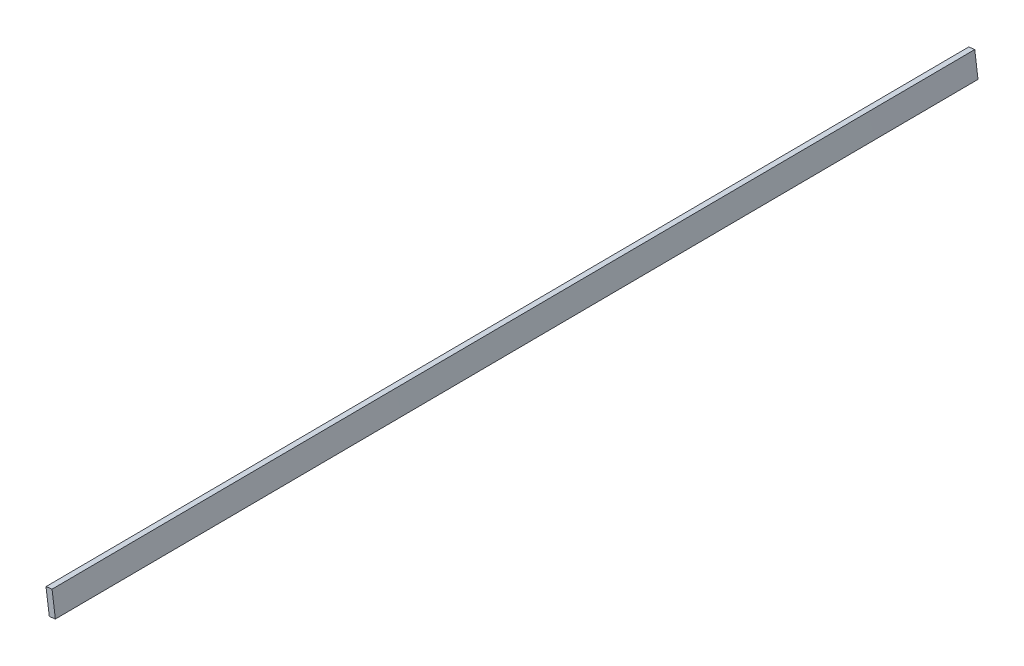
ISO-10303-21;
HEADER;
FILE_DESCRIPTION(('STEP AP214'),'2;1');
FILE_NAME('part.step','',(''),(''),'','','');
FILE_SCHEMA(('AUTOMOTIVE_DESIGN { 1 0 10303 214 1 1 1 1 }'));
ENDSEC;
DATA;
#1=APPLICATION_CONTEXT('core data for automotive mechanical design processes');
#2=APPLICATION_PROTOCOL_DEFINITION('international standard','automotive_design',2000,#1);
#3=PRODUCT_CONTEXT('',#1,'mechanical');
#4=PRODUCT('Part','Part','',(#3));
#5=PRODUCT_RELATED_PRODUCT_CATEGORY('part','',(#4));
#6=PRODUCT_DEFINITION_FORMATION('','',#4);
#7=PRODUCT_DEFINITION_CONTEXT('part definition',#1,'design');
#8=PRODUCT_DEFINITION('design','',#6,#7);
#9=PRODUCT_DEFINITION_SHAPE('','',#8);
#10=(LENGTH_UNIT() NAMED_UNIT(*) SI_UNIT(.MILLI.,.METRE.));
#11=(NAMED_UNIT(*) PLANE_ANGLE_UNIT() SI_UNIT($,.RADIAN.));
#12=(NAMED_UNIT(*) SI_UNIT($,.STERADIAN.) SOLID_ANGLE_UNIT());
#13=UNCERTAINTY_MEASURE_WITH_UNIT(LENGTH_MEASURE(1.E-05),#10,'distance_accuracy_value','');
#14=(GEOMETRIC_REPRESENTATION_CONTEXT(3) GLOBAL_UNCERTAINTY_ASSIGNED_CONTEXT((#13)) GLOBAL_UNIT_ASSIGNED_CONTEXT((#10,
#11,#12)) REPRESENTATION_CONTEXT('',''));
#15=CARTESIAN_POINT('',(0.,0.,0.));
#16=DIRECTION('',(0.,0.,1.));
#17=DIRECTION('',(1.,0.,0.));
#18=AXIS2_PLACEMENT_3D('',#15,#16,#17);
#19=CARTESIAN_POINT('',(0.,0.,-478.663));
#20=DIRECTION('',(0.,0.,-1.));
#21=DIRECTION('',(-1.,0.,0.));
#22=AXIS2_PLACEMENT_3D('',#19,#20,#21);
#23=PLANE('',#22);
#24=DIRECTION('',(0.99120712690939,0.132319430032148,0.));
#25=VECTOR('',#24,1.);
#26=CARTESIAN_POINT('',(3.15823560704575,-23.6583972694122,-478.663));
#27=LINE('',#26,#25);
#28=CARTESIAN_POINT('',(293.325645427331,15.0769843062237,-478.663));
#29=VERTEX_POINT('',#28);
#30=CARTESIAN_POINT('',(296.472728055268,15.4970984965758,-478.663));
#31=VERTEX_POINT('',#30);
#32=EDGE_CURVE('E211',#29,#31,#27,.T.);
#33=ORIENTED_EDGE('',*,*,#32,.T.);
#34=DIRECTION('',(0.131985681946742,-0.991251622828963,0.));
#35=VECTOR('',#34,1.);
#36=CARTESIAN_POINT('',(293.335609063056,39.0577927034886,-478.663));
#37=LINE('',#36,#35);
#38=CARTESIAN_POINT('',(298.149010473727,2.90772029199698,-478.663));
#39=VERTEX_POINT('',#38);
#40=EDGE_CURVE('E110',#31,#39,#37,.T.);
#41=ORIENTED_EDGE('',*,*,#40,.T.);
#42=CARTESIAN_POINT('',(423.387562730416,-0.598570683459927,-478.663));
#43=CARTESIAN_POINT('',(423.353927756293,-0.591395979490775,-478.663));
#44=CARTESIAN_POINT('',(423.21931714752,-0.562682079919149,-478.663));
#45=CARTESIAN_POINT('',(422.91635344577,-0.499447587671617,-478.663));
#46=CARTESIAN_POINT('',(422.412228818172,-0.393180215829817,-478.663));
#47=CARTESIAN_POINT('',(421.70748859617,-0.247042835446236,-478.663));
#48=CARTESIAN_POINT('',(420.803524813709,-0.0608019669566655,-478.663));
#49=CARTESIAN_POINT('',(419.701710383377,0.162485176428392,-478.663));
#50=CARTESIAN_POINT('',(418.403969401873,0.42193723491887,-478.663));
#51=CARTESIAN_POINT('',(416.912204339275,0.713898906283567,-478.663));
#52=CARTESIAN_POINT('',(415.229189009072,1.03708195332995,-478.663));
#53=CARTESIAN_POINT('',(413.357174388221,1.38616016731921,-478.663));
#54=CARTESIAN_POINT('',(411.299857620068,1.75939956386392,-478.663));
#55=CARTESIAN_POINT('',(409.060092771815,2.15209085915427,-478.663));
#56=CARTESIAN_POINT('',(406.641766459114,2.56039912737651,-478.663));
#57=CARTESIAN_POINT('',(404.04866688,2.98050952034267,-478.663));
#58=CARTESIAN_POINT('',(401.284982811694,3.40684602860176,-478.663));
#59=CARTESIAN_POINT('',(398.355056245213,3.83534149622065,-478.663));
#60=CARTESIAN_POINT('',(395.263527571514,4.26052524747009,-478.663));
#61=CARTESIAN_POINT('',(392.015373204561,4.67808858830662,-478.663));
#62=CARTESIAN_POINT('',(388.615478958681,5.08116931638825,-478.663));
#63=CARTESIAN_POINT('',(385.069286638117,5.46711366951576,-478.663));
#64=CARTESIAN_POINT('',(381.381970635892,5.82783453396013,-478.663));
#65=CARTESIAN_POINT('',(377.559192932435,6.15921060948389,-478.663));
#66=CARTESIAN_POINT('',(373.606851586853,6.45639091976692,-478.663));
#67=CARTESIAN_POINT('',(369.530453947723,6.71243770640048,-478.663));
#68=CARTESIAN_POINT('',(365.336119949899,6.92357395440403,-478.663));
#69=CARTESIAN_POINT('',(361.029807140813,7.08404404844039,-478.663));
#70=CARTESIAN_POINT('',(356.617523340991,7.18843396947195,-478.663));
#71=CARTESIAN_POINT('',(352.105426545498,7.23205813156872,-478.663));
#72=CARTESIAN_POINT('',(347.499385223467,7.21140010703142,-478.663));
#73=CARTESIAN_POINT('',(342.80568645406,7.11987185636663,-478.663));
#74=CARTESIAN_POINT('',(338.030192719595,6.95515066970667,-478.663));
#75=CARTESIAN_POINT('',(333.178936205884,6.71234985379041,-478.663));
#76=CARTESIAN_POINT('',(328.257698607244,6.38807962814831,-478.663));
#77=CARTESIAN_POINT('',(323.272118603679,5.98002284945519,-478.663));
#78=CARTESIAN_POINT('',(318.228182783313,5.48230898932139,-478.663));
#79=CARTESIAN_POINT('',(313.120651689801,4.89918891009641,-478.663));
#80=CARTESIAN_POINT('',(307.869311436917,4.18787475782382,-478.663));
#81=CARTESIAN_POINT('',(302.45646596458,3.48111483212754,-478.663));
#82=CARTESIAN_POINT('',(296.896259161603,2.74127410511817,-478.663));
#83=CARTESIAN_POINT('',(291.277526125806,1.99080851277614,-478.663));
#84=CARTESIAN_POINT('',(285.605919767471,1.22943621224605,-478.663));
#85=CARTESIAN_POINT('',(279.887290637041,0.457639017885714,-478.663));
#86=CARTESIAN_POINT('',(274.127034046233,-0.323609112130179,-478.663));
#87=CARTESIAN_POINT('',(268.330669910689,-1.11197613327778,-478.663));
#88=CARTESIAN_POINT('',(262.503543084913,-1.90586372829593,-478.663));
#89=CARTESIAN_POINT('',(256.651521274952,-2.70536888716537,-478.663));
#90=CARTESIAN_POINT('',(250.779899054847,-3.50651782193096,-478.663));
#91=CARTESIAN_POINT('',(244.894427750941,-4.30923724123935,-478.663));
#92=CARTESIAN_POINT('',(239.000567191879,-5.11132357461406,-478.663));
#93=CARTESIAN_POINT('',(233.103498264235,-5.90945278003363,-478.663));
#94=CARTESIAN_POINT('',(227.208964765834,-6.70337919450948,-478.663));
#95=CARTESIAN_POINT('',(221.322423209652,-7.49063506944608,-478.663));
#96=CARTESIAN_POINT('',(215.448997430527,-8.26717151250937,-478.663));
#97=CARTESIAN_POINT('',(209.594351574101,-9.03362813673483,-478.663));
#98=CARTESIAN_POINT('',(203.763409799043,-9.78454417055984,-478.663));
#99=CARTESIAN_POINT('',(197.96163086993,-10.5200053400287,-478.663));
#100=CARTESIAN_POINT('',(192.194232926486,-11.2365486354174,-478.663));
#101=CARTESIAN_POINT('',(186.466038684059,-11.9314142369755,-478.663));
#102=CARTESIAN_POINT('',(180.782436918827,-12.603274502764,-478.663));
#103=CARTESIAN_POINT('',(175.148233734479,-13.2482933836929,-478.663));
#104=CARTESIAN_POINT('',(169.568575962817,-13.8653038852164,-478.663));
#105=CARTESIAN_POINT('',(164.048210174808,-14.4510142998016,-478.663));
#106=CARTESIAN_POINT('',(158.592053261258,-15.0035265840128,-478.663));
#107=CARTESIAN_POINT('',(153.204921249941,-15.5202417100007,-478.663));
#108=CARTESIAN_POINT('',(147.891468535792,-15.9995243592631,-478.663));
#109=CARTESIAN_POINT('',(142.656399146351,-16.4389751743704,-478.663));
#110=CARTESIAN_POINT('',(137.504278758819,-16.8360326338407,-478.663));
#111=CARTESIAN_POINT('',(132.439787601187,-17.1897064470047,-478.663));
#112=CARTESIAN_POINT('',(127.467323045722,-17.4971602641448,-478.663));
#113=CARTESIAN_POINT('',(122.591261031339,-17.7570314908688,-478.663));
#114=CARTESIAN_POINT('',(117.815974853389,-17.9684391095265,-478.663));
#115=CARTESIAN_POINT('',(113.145771879521,-18.1292556955295,-478.663));
#116=CARTESIAN_POINT('',(108.584868364175,-18.2375350386864,-478.663));
#117=CARTESIAN_POINT('',(104.137640996795,-18.2939630983556,-478.663));
#118=CARTESIAN_POINT('',(99.8078887735024,-18.2954225965007,-478.663));
#119=CARTESIAN_POINT('',(95.5998472131619,-18.2423038335932,-478.663));
#120=CARTESIAN_POINT('',(91.5173192139185,-18.1338093844727,-478.663));
#121=CARTESIAN_POINT('',(87.5643031381508,-17.9682478198103,-478.663));
#122=CARTESIAN_POINT('',(83.7445855660069,-17.746248509974,-478.663));
#123=CARTESIAN_POINT('',(80.061874223133,-17.4671075395393,-478.663));
#124=CARTESIAN_POINT('',(76.519839715575,-17.13063972547,-478.663));
#125=CARTESIAN_POINT('',(73.1219854837755,-16.7361212710426,-478.663));
#126=CARTESIAN_POINT('',(69.8716450566022,-16.2843801388157,-478.663));
#127=CARTESIAN_POINT('',(66.7721547003917,-15.7751336760586,-478.663));
#128=CARTESIAN_POINT('',(63.8267343373244,-15.2086669368191,-478.663));
#129=CARTESIAN_POINT('',(61.0385935681709,-14.5844044129643,-478.663));
#130=CARTESIAN_POINT('',(58.4104140498924,-13.9039395891707,-478.663));
#131=CARTESIAN_POINT('',(55.9451842927062,-13.1663213913398,-478.663));
#132=CARTESIAN_POINT('',(53.6452481034751,-12.3733473758183,-478.663));
#133=CARTESIAN_POINT('',(51.513417248505,-11.5238097949324,-478.663));
#134=CARTESIAN_POINT('',(49.5520143575696,-10.6188443549477,-478.663));
#135=CARTESIAN_POINT('',(47.7628278881901,-9.65873376201667,-478.663));
#136=CARTESIAN_POINT('',(46.147868828537,-8.64407502954019,-478.663));
#137=CARTESIAN_POINT('',(44.7094832235471,-7.57379097901466,-478.663));
#138=CARTESIAN_POINT('',(43.4495535636796,-6.44836880629533,-478.663));
#139=CARTESIAN_POINT('',(42.3693155768158,-5.26841350717316,-478.663));
#140=CARTESIAN_POINT('',(41.4711549763534,-4.03269789142648,-478.663));
#141=CARTESIAN_POINT('',(40.7610437619866,-2.74155962108168,-478.663));
#142=CARTESIAN_POINT('',(40.2240782562071,-1.39842829488874,-478.663));
#143=CARTESIAN_POINT('',(40.026437002402,-0.465429755628102,-478.663));
#144=CARTESIAN_POINT('',(39.9278429354344,0.,-478.663));
#145=B_SPLINE_CURVE_WITH_KNOTS('',3,(#42,#43,#44,#45,#46,#47,#48,#49,#50,#51,#52,#53,#54,#55,
#56,#57,#58,#59,#60,#61,#62,#63,#64,#65,#66,#67,#68,#69,#70,#71,#72,#73,#74,#75,#76,#77,#78,#79,
#80,#81,#82,#83,#84,#85,#86,#87,#88,#89,#90,#91,#92,#93,#94,#95,#96,#97,#98,#99,#100,#101,#102,
#103,#104,#105,#106,#107,#108,#109,#110,#111,#112,#113,#114,#115,#116,#117,#118,#119,#120,#121,
#122,#123,#124,#125,#126,#127,#128,#129,#130,#131,#132,#133,#134,#135,#136,#137,#138,#139,#140,
#141,#142,#143,#144),.UNSPECIFIED.,.F.,.F.,(4,1,1,1,1,1,1,1,1,1,1,1,1,1,1,1,1,1,1,1,1,1,1,1,1,1,
1,1,1,1,1,1,1,1,1,1,1,1,1,1,1,1,1,1,1,1,1,1,1,1,1,1,1,1,1,1,1,1,1,1,1,1,1,1,1,1,1,1,1,1,1,1,1,1,
1,1,1,1,1,1,1,1,1,1,1,1,1,1,1,1,1,1,1,1,1,1,1,1,1,1,4),(0.,0.000263407441861152,
0.00105418354046938,0.002370412180423,0.00420937424793744,0.00656664230364534,
0.00943932529828362,0.012819753789679,0.0167027815540403,0.0210815676778737,0.0259455150023407,
0.0312877118873262,0.0370957960416438,0.0433615353737737,0.0500718116741128,0.0572152612400396,
0.0647788957380719,0.0727507221098705,0.0811160233175952,0.0898610226345078,0.0989726352727727,
0.108436394956907,0.11823658628776,0.128360674312887,0.138792302715597,0.149518641338252,
0.160525099370816,0.171796475500045,0.183320915835009,0.195083958581768,0.207073471204003,
0.219275662182765,0.231680048251389,0.244274442260697,0.257047871769566,0.269990725638771,
0.283092436221423,0.296418175051444,0.310577141849346,0.324901812537067,0.339379315631893,
0.353993476069731,0.368730577460443,0.383575671255915,0.398515484082567,0.413533959391771,
0.428618215440677,0.44375276659731,0.458921685899164,0.474112665452042,0.489310225086662,
0.504499416623933,0.519666846056783,0.534796932326458,0.549875724286475,0.564890467250726,
0.579825176535041,0.594667406411289,0.609402807723467,0.624019253145754,0.638501397294299,
0.652837209492562,0.667014500967881,0.68101931479257,0.694839720321596,0.708463964765985,
0.721880297346092,0.735076105433477,0.748040996187331,0.760763583019831,0.773232750583482,
0.785439521795172,0.797373026110578,0.80902262678145,0.820380871717842,0.83143652712263,
0.842183519415127,0.852612082472283,0.86271472951419,0.872485157300502,0.881915470474977,
0.891000132552545,0.899734087744223,0.908112589055665,0.916131607778471,0.923788842688074,
0.931081963902189,0.938011213981012,0.944577653857526,0.950785321002633,0.956638125291176,
0.962146840114847,0.967320917546812,0.972179373952079,0.9767415246109,0.981036728216416,
0.985098918921906,0.988971863590748,0.992706768868038,0.996361744803825,1.),.UNSPECIFIED.);
#146=CARTESIAN_POINT('',(295.006102188739,2.48865379447443,-478.663));
#147=VERTEX_POINT('',#146);
#148=EDGE_CURVE('E68',#39,#147,#145,.T.);
#149=ORIENTED_EDGE('',*,*,#148,.T.);
#150=DIRECTION('',(-0.132319430032147,0.99120712690939,0.));
#151=VECTOR('',#150,1.);
#152=CARTESIAN_POINT('',(290.167409820285,38.7353815756355,-478.663));
#153=LINE('',#152,#151);
#154=EDGE_CURVE('E12',#147,#29,#153,.T.);
#155=ORIENTED_EDGE('',*,*,#154,.T.);
#156=EDGE_LOOP('',(#33,#41,#149,#155));
#157=FACE_BOUND('',#156,.T.);
#158=ADVANCED_FACE('F57',(#157),#23,.T.);
#159=CARTESIAN_POINT('',(0.,0.,0.));
#160=DIRECTION('',(0.,0.,1.));
#161=DIRECTION('',(1.,0.,0.));
#162=AXIS2_PLACEMENT_3D('',#159,#160,#161);
#163=PLANE('',#162);
#164=DIRECTION('',(-0.134658441587376,0.99089207490486,0.));
#165=VECTOR('',#164,1.);
#166=CARTESIAN_POINT('',(289.604328188599,39.3561201047853,0.));
#167=LINE('',#166,#165);
#168=CARTESIAN_POINT('',(295.036807925605,-0.619102057485672,0.));
#169=VERTEX_POINT('',#168);
#170=CARTESIAN_POINT('',(293.326645717445,11.965227293806,0.));
#171=VERTEX_POINT('',#170);
#172=EDGE_CURVE('E176',#169,#171,#167,.T.);
#173=ORIENTED_EDGE('',*,*,#172,.F.);
#174=CARTESIAN_POINT('',(272.758362456909,-3.65581401828483,0.));
#175=CARTESIAN_POINT('',(273.323038862609,-3.57873827863166,0.));
#176=CARTESIAN_POINT('',(276.358796537806,-3.16431991771855,0.));
#177=CARTESIAN_POINT('',(281.854781180959,-2.41345663349635,0.));
#178=CARTESIAN_POINT('',(289.233859631028,-1.40813120619887,0.));
#179=CARTESIAN_POINT('',(296.573982386272,-0.409796640262891,0.));
#180=CARTESIAN_POINT('',(303.868380953239,0.579522999615512,0.));
#181=CARTESIAN_POINT('',(311.110065241189,1.55687474975404,0.));
#182=CARTESIAN_POINT('',(318.292203182046,2.52102495297771,0.));
#183=CARTESIAN_POINT('',(325.4073859189,3.47136371656061,0.));
#184=CARTESIAN_POINT('',(332.44845494126,4.40824789663675,0.));
#185=CARTESIAN_POINT('',(339.302915498252,5.30324075895215,0.));
#186=CARTESIAN_POINT('',(345.952856872452,6.20400082385384,0.));
#187=CARTESIAN_POINT('',(352.420688138379,6.94242450405157,0.));
#188=CARTESIAN_POINT('',(358.807986620489,7.57269564144798,0.));
#189=CARTESIAN_POINT('',(365.121387221388,8.08943105349519,0.));
#190=CARTESIAN_POINT('',(371.353308902841,8.50006492072197,0.));
#191=CARTESIAN_POINT('',(377.49661131128,8.80753139498866,0.));
#192=CARTESIAN_POINT('',(383.543972889456,9.01612314573799,0.));
#193=CARTESIAN_POINT('',(389.48775494647,9.13202833224759,0.));
#194=CARTESIAN_POINT('',(395.32053355087,9.15818824511355,0.));
#195=CARTESIAN_POINT('',(401.034347101245,9.10294556265715,0.));
#196=CARTESIAN_POINT('',(406.621764276995,8.97075324664186,0.));
#197=CARTESIAN_POINT('',(412.074986887718,8.767544826529,0.));
#198=CARTESIAN_POINT('',(417.386407281049,8.50017614669937,0.));
#199=CARTESIAN_POINT('',(422.54848099331,8.17593591941227,0.));
#200=CARTESIAN_POINT('',(427.553458196633,7.7996068660397,0.));
#201=CARTESIAN_POINT('',(432.394364707136,7.37997464832547,0.));
#202=CARTESIAN_POINT('',(437.063731759505,6.92318223197591,0.));
#203=CARTESIAN_POINT('',(441.554389355166,6.43444848566638,0.));
#204=CARTESIAN_POINT('',(445.859785012227,5.92401425015461,0.));
#205=CARTESIAN_POINT('',(449.973027478112,5.39524044171832,0.));
#206=CARTESIAN_POINT('',(453.887929886094,4.85681652022216,0.));
#207=CARTESIAN_POINT('',(457.598190253226,4.3141988780929,0.));
#208=CARTESIAN_POINT('',(461.097932514302,3.77431529482507,0.));
#209=CARTESIAN_POINT('',(464.381658047561,3.24231589208937,0.));
#210=CARTESIAN_POINT('',(467.444062606876,2.72526199021861,0.));
#211=CARTESIAN_POINT('',(470.280349075582,2.22798434817506,0.));
#212=CARTESIAN_POINT('',(472.885595604198,1.75533932329177,0.));
#213=CARTESIAN_POINT('',(475.256188039839,1.31329025898222,0.));
#214=CARTESIAN_POINT('',(477.38744454002,0.90403319739814,0.));
#215=CARTESIAN_POINT('',(479.276514699606,0.534312721305988,0.));
#216=CARTESIAN_POINT('',(480.919885908922,0.205760172731364,0.));
#217=CARTESIAN_POINT('',(482.315149055207,-0.0769954375130829,0.));
#218=CARTESIAN_POINT('',(483.459867496382,-0.312838295328672,0.));
#219=CARTESIAN_POINT('',(484.352302675222,-0.497896753791792,0.));
#220=CARTESIAN_POINT('',(484.990691913051,-0.632466588116719,0.));
#221=CARTESIAN_POINT('',(485.374344699791,-0.712542464675102,0.));
#222=CARTESIAN_POINT('',(485.544806570126,-0.748903782973926,0.));
#223=CARTESIAN_POINT('',(485.587399664,-0.757989340000014,0.));
#224=B_SPLINE_CURVE_WITH_KNOTS('',3,(#174,#175,#176,#177,#178,#179,#180,#181,#182,#183,#184,
#185,#186,#187,#188,#189,#190,#191,#192,#193,#194,#195,#196,#197,#198,#199,#200,#201,#202,#203,
#204,#205,#206,#207,#208,#209,#210,#211,#212,#213,#214,#215,#216,#217,#218,#219,#220,#221,#222,
#223),.UNSPECIFIED.,.F.,.F.,(4,1,1,1,1,1,1,1,1,1,1,1,1,1,1,1,1,1,1,1,1,1,1,1,1,1,1,1,1,1,1,1,1,
1,1,1,1,1,1,1,1,1,1,1,1,1,1,4),(0.567934832207434,0.571381784609285,0.586466040212324,
0.601484515504651,0.616424328656068,0.631269422567314,0.646006523660011,0.660620684024748,
0.675098187725839,0.689422858106043,0.70358182449163,0.716907563519481,0.730009274307503,
0.742952128081458,0.755725557616091,0.768319951608713,0.780724337258785,0.792926528422221,
0.804916041149194,0.816679083952964,0.828203524457021,0.839474900250967,0.850481358571424,
0.861207696842428,0.871639325898208,0.881763413748535,0.891563604612636,0.901027364470059,
0.910138977259583,0.918883976165486,0.927249277819328,0.935221103617664,0.94278473843867,
0.949928187937218,0.956638464326096,0.962904203571485,0.968712287841806,0.974054485103458,
0.978918431944735,0.983297218245018,0.987180245995965,0.990560674272218,0.993433357470946,
0.995790625593699,0.997629587292661,0.998945815779481,0.99973659231019,1.),.UNSPECIFIED.);
#225=CARTESIAN_POINT('',(298.182924105385,-0.19181053348416,0.));
#226=VERTEX_POINT('',#225);
#227=EDGE_CURVE('E132',#169,#226,#224,.T.);
#228=ORIENTED_EDGE('',*,*,#227,.T.);
#229=DIRECTION('',(0.134658441587371,-0.990892074904861,0.));
#230=VECTOR('',#229,1.);
#231=CARTESIAN_POINT('',(292.750410526422,39.7836606568238,0.));
#232=LINE('',#231,#230);
#233=CARTESIAN_POINT('',(296.472728055268,12.392767845846,0.));
#234=VERTEX_POINT('',#233);
#235=EDGE_CURVE('E106',#234,#226,#232,.T.);
#236=ORIENTED_EDGE('',*,*,#235,.F.);
#237=DIRECTION('',(0.99089207490486,0.13465844158738,0.));
#238=VECTOR('',#237,1.);
#239=CARTESIAN_POINT('',(3.72231752884665,-27.3908928109804,0.));
#240=LINE('',#239,#238);
#241=EDGE_CURVE('E118',#171,#234,#240,.T.);
#242=ORIENTED_EDGE('',*,*,#241,.F.);
#243=EDGE_LOOP('',(#173,#228,#236,#242));
#244=FACE_BOUND('',#243,.T.);
#245=ADVANCED_FACE('F131',(#244),#163,.T.);
#246=CARTESIAN_POINT('',(295.036807925605,-0.619102057485672,0.));
#247=CARTESIAN_POINT('',(295.006102188739,2.48865379447442,-478.663));
#248=CARTESIAN_POINT('',(294.751780890912,1.47828616772958,0.));
#249=CARTESIAN_POINT('',(294.726026061838,4.58670887976591,-478.663));
#250=CARTESIAN_POINT('',(294.466753856218,3.57567439294485,0.));
#251=CARTESIAN_POINT('',(294.445949934936,6.68476396505743,-478.663));
#252=CARTESIAN_POINT('',(293.896699786832,7.77045084337541,0.));
#253=CARTESIAN_POINT('',(293.885797681134,10.8808741356405,-478.663));
#254=CARTESIAN_POINT('',(293.611672752139,9.86783906859072,0.));
#255=CARTESIAN_POINT('',(293.605721554232,12.9789292209321,-478.663));
#256=CARTESIAN_POINT('',(293.326645717445,11.965227293806,0.));
#257=CARTESIAN_POINT('',(293.325645427331,15.0769843062237,-478.663));
#258=B_SPLINE_SURFACE_WITH_KNOTS('',3,1,((#246,#247),(#248,#249),(#250,#251),(#252,#253),(#254,
#255),(#256,#257)),.UNSPECIFIED.,.F.,.F.,.F.,(4,2,4),(2,2),(0.,0.5,1.),(0.,1.),.UNSPECIFIED.);
#259=DIRECTION('',(-2.08971442928665E-06,0.00650079755426387,-0.999978869590149));
#260=VECTOR('',#259,1.);
#261=CARTESIAN_POINT('',(293.326145572388,13.5211058000149,-239.3315));
#262=LINE('',#261,#260);
#263=EDGE_CURVE('E115',#171,#29,#262,.T.);
#264=DIRECTION('',(6.4147614595899E-05,-0.00649243903577054,0.999978921838081));
#265=VECTOR('',#264,1.);
#266=CARTESIAN_POINT('',(295.021455057172,0.934775868494372,-239.3315));
#267=LINE('',#266,#265);
#268=EDGE_CURVE('E83',#147,#169,#267,.T.);
#269=ORIENTED_EDGE('',*,*,#172,.T.);
#270=ORIENTED_EDGE('',*,*,#263,.T.);
#271=ORIENTED_EDGE('',*,*,#154,.F.);
#272=ORIENTED_EDGE('',*,*,#268,.T.);
#273=EDGE_LOOP('',(#269,#270,#271,#272));
#274=FACE_BOUND('',#273,.T.);
#275=ADVANCED_FACE('F152',(#274),#258,.T.);
#276=CARTESIAN_POINT('',(293.326645717445,11.9652272938061,0.));
#277=CARTESIAN_POINT('',(293.325645427331,15.0769843062237,-478.663));
#278=CARTESIAN_POINT('',(293.850992773749,12.0364840524794,0.));
#279=CARTESIAN_POINT('',(293.850159198654,15.1470033379491,-478.663));
#280=CARTESIAN_POINT('',(294.375339830053,12.1077408111527,0.));
#281=CARTESIAN_POINT('',(294.374672969977,15.2170223696745,-478.663));
#282=CARTESIAN_POINT('',(295.424033942661,12.2502543284993,0.));
#283=CARTESIAN_POINT('',(295.423700512623,15.3570604331252,-478.663));
#284=CARTESIAN_POINT('',(295.948380998964,12.3215110871727,0.));
#285=CARTESIAN_POINT('',(295.948214283946,15.4270794648505,-478.663));
#286=CARTESIAN_POINT('',(296.472728055268,12.392767845846,0.));
#287=CARTESIAN_POINT('',(296.472728055268,15.4970984965758,-478.663));
#288=B_SPLINE_SURFACE_WITH_KNOTS('',3,1,((#276,#277),(#278,#279),(#280,#281),(#282,#283),(#284,
#285),(#286,#287)),.UNSPECIFIED.,.F.,.F.,.F.,(4,2,4),(2,2),(0.,0.5,1.),(0.,1.),.UNSPECIFIED.);
#289=DIRECTION('',(0.,0.00648528373337653,-0.999978970326325));
#290=VECTOR('',#289,1.);
#291=CARTESIAN_POINT('',(296.472728055268,13.9449331712109,-239.3315));
#292=LINE('',#291,#290);
#293=EDGE_CURVE('E101',#234,#31,#292,.T.);
#294=ORIENTED_EDGE('',*,*,#241,.T.);
#295=ORIENTED_EDGE('',*,*,#293,.T.);
#296=ORIENTED_EDGE('',*,*,#32,.F.);
#297=ORIENTED_EDGE('',*,*,#263,.F.);
#298=EDGE_LOOP('',(#294,#295,#296,#297));
#299=FACE_BOUND('',#298,.T.);
#300=ADVANCED_FACE('F120',(#299),#288,.T.);
#301=CARTESIAN_POINT('',(298.182924105385,-0.191810533484172,0.));
#302=CARTESIAN_POINT('',(298.149010464063,2.90772029071021,-478.663000000001));
#303=CARTESIAN_POINT('',(297.77153606111,-0.247647448198452,0.));
#304=CARTESIAN_POINT('',(297.738036460832,2.85299888311781,-478.663));
#305=CARTESIAN_POINT('',(297.240415087317,-0.319755450715439,0.));
#306=CARTESIAN_POINT('',(297.207454639919,2.78229599082885,-478.663000000001));
#307=CARTESIAN_POINT('',(296.191708765441,-0.46217914367285,0.));
#308=CARTESIAN_POINT('',(296.159817101399,2.64261733002786,-478.663000000001));
#309=CARTESIAN_POINT('',(295.554390311453,-0.548764591644108,0.));
#310=CARTESIAN_POINT('',(295.523151527565,2.55767637507806,-478.663000000001));
#311=CARTESIAN_POINT('',(295.036807925605,-0.619102057485676,0.));
#312=CARTESIAN_POINT('',(295.006102188739,2.48865379447443,-478.663));
#313=B_SPLINE_SURFACE_WITH_KNOTS('',3,1,((#301,#302),(#303,#304),(#305,#306),(#307,#308),(#309,
#310),(#311,#312)),.UNSPECIFIED.,.F.,.F.,.F.,(4,1,1,4),(2,2),(0.,0.392277227659318,
0.506450563931673,1.),(0.,1.),.UNSPECIFIED.);
#314=DIRECTION('',(-7.08492626011175E-05,0.00647525678187677,-0.999979032795183));
#315=VECTOR('',#314,1.);
#316=CARTESIAN_POINT('',(298.165967289556,1.35795487925641,-239.3315));
#317=LINE('',#316,#315);
#318=EDGE_CURVE('E114',#226,#39,#317,.T.);
#319=ORIENTED_EDGE('',*,*,#227,.F.);
#320=ORIENTED_EDGE('',*,*,#268,.F.);
#321=ORIENTED_EDGE('',*,*,#148,.F.);
#322=ORIENTED_EDGE('',*,*,#318,.F.);
#323=EDGE_LOOP('',(#319,#320,#321,#322));
#324=FACE_BOUND('',#323,.T.);
#325=ADVANCED_FACE('F225',(#324),#313,.T.);
#326=CARTESIAN_POINT('',(296.472728055268,12.392767845846,0.));
#327=CARTESIAN_POINT('',(296.472728055268,15.4970984965758,-478.663));
#328=CARTESIAN_POINT('',(296.757760730288,10.2953381159576,0.));
#329=CARTESIAN_POINT('',(296.752108458345,13.3988687958126,-478.663));
#330=CARTESIAN_POINT('',(297.042793405307,8.19790838606931,0.));
#331=CARTESIAN_POINT('',(297.031488861421,11.3006390950495,-478.663));
#332=CARTESIAN_POINT('',(297.612858755346,4.0030489262926,0.));
#333=CARTESIAN_POINT('',(297.590249667574,7.10417969352324,-478.663));
#334=CARTESIAN_POINT('',(297.897891430366,1.90561919640423,0.));
#335=CARTESIAN_POINT('',(297.86963007065,5.00594999276011,-478.663));
#336=CARTESIAN_POINT('',(298.182924105385,-0.19181053348416,0.));
#337=CARTESIAN_POINT('',(298.149010473727,2.90772029199698,-478.663));
#338=B_SPLINE_SURFACE_WITH_KNOTS('',3,1,((#326,#327),(#328,#329),(#330,#331),(#332,#333),(#334,
#335),(#336,#337)),.UNSPECIFIED.,.F.,.F.,.F.,(4,2,4),(2,2),(0.,0.5,1.),(0.,1.),.UNSPECIFIED.);
#339=ORIENTED_EDGE('',*,*,#235,.T.);
#340=ORIENTED_EDGE('',*,*,#318,.T.);
#341=ORIENTED_EDGE('',*,*,#40,.F.);
#342=ORIENTED_EDGE('',*,*,#293,.F.);
#343=EDGE_LOOP('',(#339,#340,#341,#342));
#344=FACE_BOUND('',#343,.T.);
#345=ADVANCED_FACE('F103',(#344),#338,.T.);
#346=CLOSED_SHELL('',(#158,#245,#275,#300,#325,#345));
#347=MANIFOLD_SOLID_BREP('B2',#346);
#348=ADVANCED_BREP_SHAPE_REPRESENTATION('',(#18,#347),#14);
#349=SHAPE_DEFINITION_REPRESENTATION(#9,#348);
ENDSEC;
END-ISO-10303-21;
